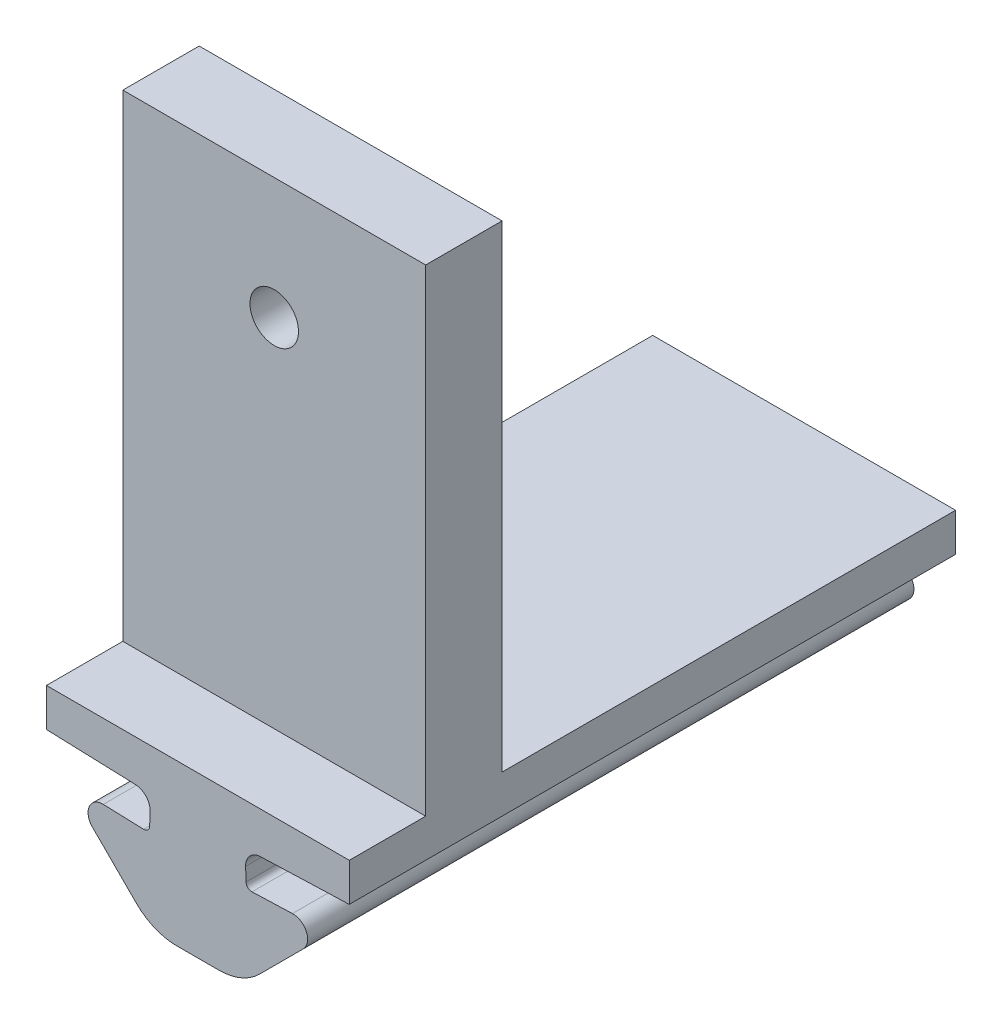
ISO-10303-21;
HEADER;
FILE_DESCRIPTION(('STEP AP214'),'2;1');
FILE_NAME('part.step','',(''),(''),'','','');
FILE_SCHEMA(('AUTOMOTIVE_DESIGN { 1 0 10303 214 1 1 1 1 }'));
ENDSEC;
DATA;
#1=APPLICATION_CONTEXT('core data for automotive mechanical design processes');
#2=APPLICATION_PROTOCOL_DEFINITION('international standard','automotive_design',2000,#1);
#3=PRODUCT_CONTEXT('',#1,'mechanical');
#4=PRODUCT('Part','Part','',(#3));
#5=PRODUCT_RELATED_PRODUCT_CATEGORY('part','',(#4));
#6=PRODUCT_DEFINITION_FORMATION('','',#4);
#7=PRODUCT_DEFINITION_CONTEXT('part definition',#1,'design');
#8=PRODUCT_DEFINITION('design','',#6,#7);
#9=PRODUCT_DEFINITION_SHAPE('','',#8);
#10=(LENGTH_UNIT() NAMED_UNIT(*) SI_UNIT(.MILLI.,.METRE.));
#11=(NAMED_UNIT(*) PLANE_ANGLE_UNIT() SI_UNIT($,.RADIAN.));
#12=(NAMED_UNIT(*) SI_UNIT($,.STERADIAN.) SOLID_ANGLE_UNIT());
#13=UNCERTAINTY_MEASURE_WITH_UNIT(LENGTH_MEASURE(1.E-05),#10,'distance_accuracy_value','');
#14=(GEOMETRIC_REPRESENTATION_CONTEXT(3) GLOBAL_UNCERTAINTY_ASSIGNED_CONTEXT((#13)) GLOBAL_UNIT_ASSIGNED_CONTEXT((#10,
#11,#12)) REPRESENTATION_CONTEXT('',''));
#15=CARTESIAN_POINT('',(0.,0.,0.));
#16=DIRECTION('',(0.,0.,1.));
#17=DIRECTION('',(1.,0.,0.));
#18=AXIS2_PLACEMENT_3D('',#15,#16,#17);
#19=CARTESIAN_POINT('',(0.,49.2995338889829,0.));
#20=DIRECTION('',(0.,1.,0.));
#21=DIRECTION('',(0.,0.,1.));
#22=AXIS2_PLACEMENT_3D('',#19,#20,#21);
#23=PLANE('',#22);
#24=DIRECTION('',(-1.,0.,0.));
#25=VECTOR('',#24,1.);
#26=CARTESIAN_POINT('',(-55.7809025544344,49.2995338889829,23.75));
#27=LINE('',#26,#25);
#28=CARTESIAN_POINT('',(-39.9205005412442,49.2995338889829,23.75));
#29=VERTEX_POINT('',#28);
#30=CARTESIAN_POINT('',(-55.7809025544344,49.2995338889829,23.75));
#31=VERTEX_POINT('',#30);
#32=EDGE_CURVE('E63',#29,#31,#27,.T.);
#33=ORIENTED_EDGE('',*,*,#32,.F.);
#34=DIRECTION('',(0.,0.,-1.));
#35=VECTOR('',#34,1.);
#36=CARTESIAN_POINT('',(-39.9205005412442,49.2995338889829,0.));
#37=LINE('',#36,#35);
#38=CARTESIAN_POINT('',(-39.9205005412442,49.2995338889829,0.));
#39=VERTEX_POINT('',#38);
#40=EDGE_CURVE('E249',#29,#39,#37,.T.);
#41=ORIENTED_EDGE('',*,*,#40,.T.);
#42=DIRECTION('',(-1.,0.,0.));
#43=VECTOR('',#42,1.);
#44=CARTESIAN_POINT('',(-55.7809025544344,49.2995338889829,0.));
#45=LINE('',#44,#43);
#46=CARTESIAN_POINT('',(-55.7809025544344,49.2995338889829,0.));
#47=VERTEX_POINT('',#46);
#48=EDGE_CURVE('E253',#39,#47,#45,.T.);
#49=ORIENTED_EDGE('',*,*,#48,.T.);
#50=DIRECTION('',(0.,0.,1.));
#51=VECTOR('',#50,1.);
#52=CARTESIAN_POINT('',(-55.7809025544344,49.2995338889829,0.));
#53=LINE('',#52,#51);
#54=EDGE_CURVE('E239',#47,#31,#53,.T.);
#55=ORIENTED_EDGE('',*,*,#54,.T.);
#56=EDGE_LOOP('',(#33,#41,#49,#55));
#57=FACE_BOUND('',#56,.T.);
#58=ADVANCED_FACE('F47',(#57),#23,.T.);
#59=CARTESIAN_POINT('',(-50.6754357820215,45.6203327442278,31.75));
#60=DIRECTION('',(0.,0.,-1.));
#61=DIRECTION('',(-1.,0.,0.));
#62=AXIS2_PLACEMENT_3D('',#59,#60,#61);
#63=CYLINDRICAL_SURFACE('',#62,0.300000000000002);
#64=CARTESIAN_POINT('',(-50.6754357820215,45.6203327442278,0.));
#65=DIRECTION('',(0.,0.,-1.));
#66=DIRECTION('',(1.,0.,0.));
#67=AXIS2_PLACEMENT_3D('',#64,#65,#66);
#68=CIRCLE('',#67,0.300000000000002);
#69=CARTESIAN_POINT('',(-50.3756185339158,45.609862895217,0.));
#70=VERTEX_POINT('',#69);
#71=CARTESIAN_POINT('',(-50.6859056310322,45.320515496122,0.));
#72=VERTEX_POINT('',#71);
#73=EDGE_CURVE('E365',#70,#72,#68,.T.);
#74=ORIENTED_EDGE('',*,*,#73,.T.);
#75=DIRECTION('',(0.,0.,-1.));
#76=VECTOR('',#75,1.);
#77=CARTESIAN_POINT('',(-50.6859056310322,45.320515496122,31.75));
#78=LINE('',#77,#76);
#79=CARTESIAN_POINT('',(-50.6859056310322,45.320515496122,31.75));
#80=VERTEX_POINT('',#79);
#81=EDGE_CURVE('E11',#80,#72,#78,.T.);
#82=ORIENTED_EDGE('',*,*,#81,.F.);
#83=CARTESIAN_POINT('',(-50.6754357820215,45.6203327442278,31.75));
#84=DIRECTION('',(0.,0.,-1.));
#85=DIRECTION('',(1.,0.,0.));
#86=AXIS2_PLACEMENT_3D('',#83,#84,#85);
#87=CIRCLE('',#86,0.300000000000002);
#88=CARTESIAN_POINT('',(-50.3756185339158,45.609862895217,31.75));
#89=VERTEX_POINT('',#88);
#90=EDGE_CURVE('E366',#89,#80,#87,.T.);
#91=ORIENTED_EDGE('',*,*,#90,.F.);
#92=DIRECTION('',(0.,0.,-1.));
#93=VECTOR('',#92,1.);
#94=CARTESIAN_POINT('',(-50.3756185339158,45.609862895217,31.75));
#95=LINE('',#94,#93);
#96=EDGE_CURVE('E395',#89,#70,#95,.T.);
#97=ORIENTED_EDGE('',*,*,#96,.T.);
#98=EDGE_LOOP('',(#74,#82,#91,#97));
#99=FACE_BOUND('',#98,.T.);
#100=ADVANCED_FACE('F49',(#99),#63,.F.);
#101=CARTESIAN_POINT('',(-50.6859056310322,45.320515496122,31.75));
#102=DIRECTION('',(-0.0348994967024436,-0.999390827019098,0.));
#103=DIRECTION('',(0.999390827019098,-0.0348994967024436,0.));
#104=AXIS2_PLACEMENT_3D('',#101,#102,#103);
#105=PLANE('',#104);
#106=DIRECTION('',(-0.999390827019098,0.0348994967024436,0.));
#107=VECTOR('',#106,1.);
#108=CARTESIAN_POINT('',(-50.6859056310322,45.320515496122,0.));
#109=LINE('',#108,#107);
#110=CARTESIAN_POINT('',(-52.803734095959,45.3944716957687,0.));
#111=VERTEX_POINT('',#110);
#112=EDGE_CURVE('E399',#72,#111,#109,.T.);
#113=ORIENTED_EDGE('',*,*,#112,.T.);
#114=DIRECTION('',(0.,0.,-1.));
#115=VECTOR('',#114,1.);
#116=CARTESIAN_POINT('',(-52.803734095959,45.3944716957687,31.75));
#117=LINE('',#116,#115);
#118=CARTESIAN_POINT('',(-52.803734095959,45.3944716957687,31.75));
#119=VERTEX_POINT('',#118);
#120=EDGE_CURVE('E56',#119,#111,#117,.T.);
#121=ORIENTED_EDGE('',*,*,#120,.F.);
#122=DIRECTION('',(-0.999390827019098,0.0348994967024436,0.));
#123=VECTOR('',#122,1.);
#124=CARTESIAN_POINT('',(-50.6859056310322,45.320515496122,31.75));
#125=LINE('',#124,#123);
#126=EDGE_CURVE('E370',#80,#119,#125,.T.);
#127=ORIENTED_EDGE('',*,*,#126,.F.);
#128=ORIENTED_EDGE('',*,*,#81,.T.);
#129=EDGE_LOOP('',(#113,#121,#127,#128));
#130=FACE_BOUND('',#129,.T.);
#131=ADVANCED_FACE('F477',(#130),#105,.F.);
#132=CARTESIAN_POINT('',(-52.8306099066512,44.6248491736012,31.75));
#133=DIRECTION('',(0.,0.,-1.));
#134=DIRECTION('',(-1.,0.,0.));
#135=AXIS2_PLACEMENT_3D('',#132,#133,#134);
#136=CYLINDRICAL_SURFACE('',#135,0.770091641188153);
#137=CARTESIAN_POINT('',(-52.8306099066512,44.6248491736012,0.));
#138=DIRECTION('',(0.,0.,1.));
#139=DIRECTION('',(1.,0.,0.));
#140=AXIS2_PLACEMENT_3D('',#137,#138,#139);
#141=CIRCLE('',#140,0.770091641188153);
#142=CARTESIAN_POINT('',(-53.3751469282704,44.0803121519819,0.));
#143=VERTEX_POINT('',#142);
#144=EDGE_CURVE('E402',#111,#143,#141,.T.);
#145=ORIENTED_EDGE('',*,*,#144,.T.);
#146=DIRECTION('',(0.,0.,-1.));
#147=VECTOR('',#146,1.);
#148=CARTESIAN_POINT('',(-53.3751469282704,44.0803121519819,31.75));
#149=LINE('',#148,#147);
#150=CARTESIAN_POINT('',(-53.3751469282704,44.0803121519819,31.75));
#151=VERTEX_POINT('',#150);
#152=EDGE_CURVE('E444',#151,#143,#149,.T.);
#153=ORIENTED_EDGE('',*,*,#152,.F.);
#154=CARTESIAN_POINT('',(-52.8306099066512,44.6248491736012,31.75));
#155=DIRECTION('',(0.,0.,1.));
#156=DIRECTION('',(1.,0.,0.));
#157=AXIS2_PLACEMENT_3D('',#154,#155,#156);
#158=CIRCLE('',#157,0.770091641188153);
#159=EDGE_CURVE('E374',#119,#151,#158,.T.);
#160=ORIENTED_EDGE('',*,*,#159,.F.);
#161=ORIENTED_EDGE('',*,*,#120,.T.);
#162=EDGE_LOOP('',(#145,#153,#160,#161));
#163=FACE_BOUND('',#162,.T.);
#164=ADVANCED_FACE('F453',(#163),#136,.T.);
#165=CARTESIAN_POINT('',(-51.0742666676735,41.7794318913851,31.75));
#166=DIRECTION('',(0.707106781186544,0.707106781186551,0.));
#167=DIRECTION('',(-0.707106781186551,0.707106781186544,0.));
#168=AXIS2_PLACEMENT_3D('',#165,#166,#167);
#169=PLANE('',#168);
#170=DIRECTION('',(0.707106781186551,-0.707106781186544,0.));
#171=VECTOR('',#170,1.);
#172=CARTESIAN_POINT('',(-51.0742666676735,41.7794318913851,0.));
#173=LINE('',#172,#171);
#174=CARTESIAN_POINT('',(-51.0742666676735,41.7794318913851,0.));
#175=VERTEX_POINT('',#174);
#176=EDGE_CURVE('E405',#143,#175,#173,.T.);
#177=ORIENTED_EDGE('',*,*,#176,.T.);
#178=DIRECTION('',(0.,0.,-1.));
#179=VECTOR('',#178,1.);
#180=CARTESIAN_POINT('',(-51.0742666676735,41.7794318913851,31.75));
#181=LINE('',#180,#179);
#182=CARTESIAN_POINT('',(-51.0742666676735,41.7794318913851,31.75));
#183=VERTEX_POINT('',#182);
#184=EDGE_CURVE('E440',#183,#175,#181,.T.);
#185=ORIENTED_EDGE('',*,*,#184,.F.);
#186=DIRECTION('',(0.707106781186551,-0.707106781186544,0.));
#187=VECTOR('',#186,1.);
#188=CARTESIAN_POINT('',(-51.0742666676735,41.7794318913851,31.75));
#189=LINE('',#188,#187);
#190=EDGE_CURVE('E377',#151,#183,#189,.T.);
#191=ORIENTED_EDGE('',*,*,#190,.F.);
#192=ORIENTED_EDGE('',*,*,#152,.T.);
#193=EDGE_LOOP('',(#177,#185,#191,#192));
#194=FACE_BOUND('',#193,.T.);
#195=ADVANCED_FACE('F464',(#194),#169,.F.);
#196=CARTESIAN_POINT('',(-48.9529463241139,43.9007522349447,31.75));
#197=DIRECTION('',(0.,0.,-1.));
#198=DIRECTION('',(-1.,0.,0.));
#199=AXIS2_PLACEMENT_3D('',#196,#197,#198);
#200=CYLINDRICAL_SURFACE('',#199,3.);
#201=CARTESIAN_POINT('',(-48.9529463241139,43.9007522349447,0.));
#202=DIRECTION('',(0.,0.,1.));
#203=DIRECTION('',(1.,0.,0.));
#204=AXIS2_PLACEMENT_3D('',#201,#202,#203);
#205=CIRCLE('',#204,3.);
#206=CARTESIAN_POINT('',(-48.9529463241139,40.9007522349447,0.));
#207=VERTEX_POINT('',#206);
#208=EDGE_CURVE('E408',#175,#207,#205,.T.);
#209=ORIENTED_EDGE('',*,*,#208,.T.);
#210=DIRECTION('',(0.,0.,-1.));
#211=VECTOR('',#210,1.);
#212=CARTESIAN_POINT('',(-48.9529463241139,40.9007522349447,31.75));
#213=LINE('',#212,#211);
#214=CARTESIAN_POINT('',(-48.9529463241139,40.9007522349447,31.75));
#215=VERTEX_POINT('',#214);
#216=EDGE_CURVE('E436',#215,#207,#213,.T.);
#217=ORIENTED_EDGE('',*,*,#216,.F.);
#218=CARTESIAN_POINT('',(-48.9529463241139,43.9007522349447,31.75));
#219=DIRECTION('',(0.,0.,1.));
#220=DIRECTION('',(1.,0.,0.));
#221=AXIS2_PLACEMENT_3D('',#218,#219,#220);
#222=CIRCLE('',#221,3.);
#223=EDGE_CURVE('E380',#183,#215,#222,.T.);
#224=ORIENTED_EDGE('',*,*,#223,.F.);
#225=ORIENTED_EDGE('',*,*,#184,.T.);
#226=EDGE_LOOP('',(#209,#217,#224,#225));
#227=FACE_BOUND('',#226,.T.);
#228=ADVANCED_FACE('F468',(#227),#200,.T.);
#229=CARTESIAN_POINT('',(-47.8507015478393,40.9007522349447,31.75));
#230=DIRECTION('',(0.,1.,0.));
#231=DIRECTION('',(0.,0.,1.));
#232=AXIS2_PLACEMENT_3D('',#229,#230,#231);
#233=PLANE('',#232);
#234=DIRECTION('',(1.,0.,0.));
#235=VECTOR('',#234,1.);
#236=CARTESIAN_POINT('',(-47.8507015478393,40.9007522349447,0.));
#237=LINE('',#236,#235);
#238=CARTESIAN_POINT('',(-46.7484567715648,40.9007522349447,0.));
#239=VERTEX_POINT('',#238);
#240=EDGE_CURVE('E411',#207,#239,#237,.T.);
#241=ORIENTED_EDGE('',*,*,#240,.T.);
#242=DIRECTION('',(0.,0.,-1.));
#243=VECTOR('',#242,1.);
#244=CARTESIAN_POINT('',(-46.7484567715648,40.9007522349447,31.75));
#245=LINE('',#244,#243);
#246=CARTESIAN_POINT('',(-46.7484567715648,40.9007522349447,31.75));
#247=VERTEX_POINT('',#246);
#248=EDGE_CURVE('E348',#247,#239,#245,.T.);
#249=ORIENTED_EDGE('',*,*,#248,.F.);
#250=DIRECTION('',(1.,0.,0.));
#251=VECTOR('',#250,1.);
#252=CARTESIAN_POINT('',(-47.8507015478393,40.9007522349447,31.75));
#253=LINE('',#252,#251);
#254=EDGE_CURVE('E383',#215,#247,#253,.T.);
#255=ORIENTED_EDGE('',*,*,#254,.F.);
#256=ORIENTED_EDGE('',*,*,#216,.T.);
#257=EDGE_LOOP('',(#241,#249,#255,#256));
#258=FACE_BOUND('',#257,.T.);
#259=ADVANCED_FACE('F595',(#258),#233,.F.);
#260=CARTESIAN_POINT('',(-55.7809025544344,47.2995338889829,31.75));
#261=DIRECTION('',(0.0348994967024436,0.999390827019098,0.));
#262=DIRECTION('',(-0.999390827019098,0.0348994967024436,0.));
#263=AXIS2_PLACEMENT_3D('',#260,#261,#262);
#264=PLANE('',#263);
#265=DIRECTION('',(0.999390827019098,-0.0348994967024436,0.));
#266=VECTOR('',#265,1.);
#267=CARTESIAN_POINT('',(-55.7809025544344,47.2995338889829,0.));
#268=LINE('',#267,#266);
#269=CARTESIAN_POINT('',(-55.7809025544344,47.2995338889829,0.));
#270=VERTEX_POINT('',#269);
#271=CARTESIAN_POINT('',(-51.1227819504774,47.1368687331076,0.));
#272=VERTEX_POINT('',#271);
#273=EDGE_CURVE('E414',#270,#272,#268,.T.);
#274=ORIENTED_EDGE('',*,*,#273,.T.);
#275=DIRECTION('',(0.,0.,-1.));
#276=VECTOR('',#275,1.);
#277=CARTESIAN_POINT('',(-51.1227819504774,47.1368687331076,31.75));
#278=LINE('',#277,#276);
#279=CARTESIAN_POINT('',(-51.1227819504774,47.1368687331076,31.75));
#280=VERTEX_POINT('',#279);
#281=EDGE_CURVE('E429',#280,#272,#278,.T.);
#282=ORIENTED_EDGE('',*,*,#281,.F.);
#283=DIRECTION('',(0.999390827019098,-0.0348994967024436,0.));
#284=VECTOR('',#283,1.);
#285=CARTESIAN_POINT('',(-55.7809025544344,47.2995338889829,31.75));
#286=LINE('',#285,#284);
#287=CARTESIAN_POINT('',(-55.7809025544344,47.2995338889829,31.75));
#288=VERTEX_POINT('',#287);
#289=EDGE_CURVE('E386',#288,#280,#286,.T.);
#290=ORIENTED_EDGE('',*,*,#289,.F.);
#291=DIRECTION('',(0.,0.,-1.));
#292=VECTOR('',#291,1.);
#293=CARTESIAN_POINT('',(-55.7809025544344,47.2995338889829,31.75));
#294=LINE('',#293,#292);
#295=EDGE_CURVE('E433',#288,#270,#294,.T.);
#296=ORIENTED_EDGE('',*,*,#295,.T.);
#297=EDGE_LOOP('',(#274,#282,#290,#296));
#298=FACE_BOUND('',#297,.T.);
#299=ADVANCED_FACE('F492',(#298),#264,.F.);
#300=CARTESIAN_POINT('',(-51.1507015478393,46.3373560714924,31.75));
#301=DIRECTION('',(0.,0.,-1.));
#302=DIRECTION('',(-1.,0.,0.));
#303=AXIS2_PLACEMENT_3D('',#300,#301,#302);
#304=CYLINDRICAL_SURFACE('',#303,0.799999999999997);
#305=CARTESIAN_POINT('',(-51.1507015478393,46.3373560714924,0.));
#306=DIRECTION('',(0.,0.,-1.));
#307=DIRECTION('',(1.,0.,0.));
#308=AXIS2_PLACEMENT_3D('',#305,#306,#307);
#309=CIRCLE('',#308,0.799999999999997);
#310=CARTESIAN_POINT('',(-50.3511888862241,46.3094364741304,0.));
#311=VERTEX_POINT('',#310);
#312=EDGE_CURVE('E417',#272,#311,#309,.T.);
#313=ORIENTED_EDGE('',*,*,#312,.T.);
#314=DIRECTION('',(0.,0.,-1.));
#315=VECTOR('',#314,1.);
#316=CARTESIAN_POINT('',(-50.3511888862241,46.3094364741304,31.75));
#317=LINE('',#316,#315);
#318=CARTESIAN_POINT('',(-50.3511888862241,46.3094364741304,31.75));
#319=VERTEX_POINT('',#318);
#320=EDGE_CURVE('E425',#319,#311,#317,.T.);
#321=ORIENTED_EDGE('',*,*,#320,.F.);
#322=CARTESIAN_POINT('',(-51.1507015478393,46.3373560714924,31.75));
#323=DIRECTION('',(0.,0.,-1.));
#324=DIRECTION('',(1.,0.,0.));
#325=AXIS2_PLACEMENT_3D('',#322,#323,#324);
#326=CIRCLE('',#325,0.799999999999997);
#327=EDGE_CURVE('E389',#280,#319,#326,.T.);
#328=ORIENTED_EDGE('',*,*,#327,.F.);
#329=ORIENTED_EDGE('',*,*,#281,.T.);
#330=EDGE_LOOP('',(#313,#321,#328,#329));
#331=FACE_BOUND('',#330,.T.);
#332=ADVANCED_FACE('F489',(#331),#304,.F.);
#333=CARTESIAN_POINT('',(-50.3756185339158,45.609862895217,31.75));
#334=DIRECTION('',(0.999390827019098,-0.034899496702436,0.));
#335=DIRECTION('',(0.034899496702436,0.999390827019098,0.));
#336=AXIS2_PLACEMENT_3D('',#333,#334,#335);
#337=PLANE('',#336);
#338=DIRECTION('',(-0.034899496702436,-0.999390827019098,0.));
#339=VECTOR('',#338,1.);
#340=CARTESIAN_POINT('',(-50.3756185339158,45.609862895217,0.));
#341=LINE('',#340,#339);
#342=EDGE_CURVE('E371',#311,#70,#341,.T.);
#343=ORIENTED_EDGE('',*,*,#342,.T.);
#344=ORIENTED_EDGE('',*,*,#96,.F.);
#345=DIRECTION('',(-0.034899496702436,-0.999390827019098,0.));
#346=VECTOR('',#345,1.);
#347=CARTESIAN_POINT('',(-50.3756185339158,45.609862895217,31.75));
#348=LINE('',#347,#346);
#349=EDGE_CURVE('E392',#319,#89,#348,.T.);
#350=ORIENTED_EDGE('',*,*,#349,.F.);
#351=ORIENTED_EDGE('',*,*,#320,.T.);
#352=EDGE_LOOP('',(#343,#344,#350,#351));
#353=FACE_BOUND('',#352,.T.);
#354=ADVANCED_FACE('F484',(#353),#337,.F.);
#355=CARTESIAN_POINT('',(-50.6754357820215,45.6203327442278,31.75));
#356=DIRECTION('',(0.,0.,1.));
#357=DIRECTION('',(1.,0.,0.));
#358=AXIS2_PLACEMENT_3D('',#355,#356,#357);
#359=PLANE('',#358);
#360=ORIENTED_EDGE('',*,*,#90,.T.);
#361=ORIENTED_EDGE('',*,*,#126,.T.);
#362=ORIENTED_EDGE('',*,*,#159,.T.);
#363=ORIENTED_EDGE('',*,*,#190,.T.);
#364=ORIENTED_EDGE('',*,*,#223,.T.);
#365=ORIENTED_EDGE('',*,*,#254,.T.);
#366=CARTESIAN_POINT('',(-46.7484567715648,43.9007522349447,31.75));
#367=DIRECTION('',(0.,0.,-1.));
#368=DIRECTION('',(-1.,0.,0.));
#369=AXIS2_PLACEMENT_3D('',#366,#367,#368);
#370=CIRCLE('',#369,3.);
#371=CARTESIAN_POINT('',(-44.6271364280052,41.7794318913851,31.75));
#372=VERTEX_POINT('',#371);
#373=EDGE_CURVE('E290',#372,#247,#370,.T.);
#374=ORIENTED_EDGE('',*,*,#373,.F.);
#375=DIRECTION('',(-0.707106781186551,-0.707106781186544,0.));
#376=VECTOR('',#375,1.);
#377=CARTESIAN_POINT('',(-44.6271364280052,41.7794318913851,31.75));
#378=LINE('',#377,#376);
#379=CARTESIAN_POINT('',(-42.3262561674083,44.0803121519819,31.75));
#380=VERTEX_POINT('',#379);
#381=EDGE_CURVE('E294',#380,#372,#378,.T.);
#382=ORIENTED_EDGE('',*,*,#381,.F.);
#383=CARTESIAN_POINT('',(-42.8707931890275,44.6248491736012,31.75));
#384=DIRECTION('',(0.,0.,-1.));
#385=DIRECTION('',(-1.,0.,0.));
#386=AXIS2_PLACEMENT_3D('',#383,#384,#385);
#387=CIRCLE('',#386,0.770091641188153);
#388=CARTESIAN_POINT('',(-42.8976689997197,45.3944716957687,31.75));
#389=VERTEX_POINT('',#388);
#390=EDGE_CURVE('E298',#389,#380,#387,.T.);
#391=ORIENTED_EDGE('',*,*,#390,.F.);
#392=DIRECTION('',(0.999390827019098,0.0348994967024436,0.));
#393=VECTOR('',#392,1.);
#394=CARTESIAN_POINT('',(-45.0154974646464,45.320515496122,31.75));
#395=LINE('',#394,#393);
#396=CARTESIAN_POINT('',(-45.0154974646464,45.320515496122,31.75));
#397=VERTEX_POINT('',#396);
#398=EDGE_CURVE('E302',#397,#389,#395,.T.);
#399=ORIENTED_EDGE('',*,*,#398,.F.);
#400=CARTESIAN_POINT('',(-45.0259673136572,45.6203327442278,31.75));
#401=DIRECTION('',(0.,0.,1.));
#402=DIRECTION('',(-1.,0.,0.));
#403=AXIS2_PLACEMENT_3D('',#400,#401,#402);
#404=CIRCLE('',#403,0.300000000000002);
#405=CARTESIAN_POINT('',(-45.3257845617629,45.609862895217,31.75));
#406=VERTEX_POINT('',#405);
#407=EDGE_CURVE('E273',#406,#397,#404,.T.);
#408=ORIENTED_EDGE('',*,*,#407,.F.);
#409=DIRECTION('',(0.034899496702436,-0.999390827019098,0.));
#410=VECTOR('',#409,1.);
#411=CARTESIAN_POINT('',(-45.3257845617629,45.609862895217,31.75));
#412=LINE('',#411,#410);
#413=CARTESIAN_POINT('',(-45.3502142094546,46.3094364741304,31.75));
#414=VERTEX_POINT('',#413);
#415=EDGE_CURVE('E277',#414,#406,#412,.T.);
#416=ORIENTED_EDGE('',*,*,#415,.F.);
#417=CARTESIAN_POINT('',(-44.5507015478393,46.3373560714924,31.75));
#418=DIRECTION('',(0.,0.,1.));
#419=DIRECTION('',(-1.,0.,0.));
#420=AXIS2_PLACEMENT_3D('',#417,#418,#419);
#421=CIRCLE('',#420,0.799999999999997);
#422=CARTESIAN_POINT('',(-44.5786211452013,47.1368687331076,31.75));
#423=VERTEX_POINT('',#422);
#424=EDGE_CURVE('E282',#423,#414,#421,.T.);
#425=ORIENTED_EDGE('',*,*,#424,.F.);
#426=DIRECTION('',(-0.999390827019098,-0.0348994967024436,0.));
#427=VECTOR('',#426,1.);
#428=CARTESIAN_POINT('',(-39.9205005412442,47.2995338889829,31.75));
#429=LINE('',#428,#427);
#430=CARTESIAN_POINT('',(-39.9205005412442,47.2995338889829,31.75));
#431=VERTEX_POINT('',#430);
#432=EDGE_CURVE('E286',#431,#423,#429,.T.);
#433=ORIENTED_EDGE('',*,*,#432,.F.);
#434=DIRECTION('',(0.,-1.,0.));
#435=VECTOR('',#434,1.);
#436=CARTESIAN_POINT('',(-39.9205005412442,49.2995338889829,31.75));
#437=LINE('',#436,#435);
#438=CARTESIAN_POINT('',(-39.9205005412442,49.2995338889829,31.75));
#439=VERTEX_POINT('',#438);
#440=EDGE_CURVE('E264',#439,#431,#437,.T.);
#441=ORIENTED_EDGE('',*,*,#440,.F.);
#442=DIRECTION('',(1.,0.,0.));
#443=VECTOR('',#442,1.);
#444=CARTESIAN_POINT('',(-55.7809025544344,49.2995338889829,31.75));
#445=LINE('',#444,#443);
#446=CARTESIAN_POINT('',(-55.7809025544344,49.2995338889829,31.75));
#447=VERTEX_POINT('',#446);
#448=EDGE_CURVE('E246',#447,#439,#445,.T.);
#449=ORIENTED_EDGE('',*,*,#448,.F.);
#450=DIRECTION('',(0.,-1.,0.));
#451=VECTOR('',#450,1.);
#452=CARTESIAN_POINT('',(-55.7809025544344,49.2995338889829,31.75));
#453=LINE('',#452,#451);
#454=EDGE_CURVE('E268',#447,#288,#453,.T.);
#455=ORIENTED_EDGE('',*,*,#454,.T.);
#456=ORIENTED_EDGE('',*,*,#289,.T.);
#457=ORIENTED_EDGE('',*,*,#327,.T.);
#458=ORIENTED_EDGE('',*,*,#349,.T.);
#459=EDGE_LOOP('',(#360,#361,#362,#363,#364,#365,#374,#382,#391,#399,#408,#416,#425,#433,#441,
#449,#455,#456,#457,#458));
#460=FACE_BOUND('',#459,.T.);
#461=ADVANCED_FACE('F472',(#460),#359,.T.);
#462=CARTESIAN_POINT('',(-50.6754357820215,45.6203327442278,0.));
#463=DIRECTION('',(0.,0.,1.));
#464=DIRECTION('',(1.,0.,0.));
#465=AXIS2_PLACEMENT_3D('',#462,#463,#464);
#466=PLANE('',#465);
#467=ORIENTED_EDGE('',*,*,#73,.F.);
#468=ORIENTED_EDGE('',*,*,#342,.F.);
#469=ORIENTED_EDGE('',*,*,#312,.F.);
#470=ORIENTED_EDGE('',*,*,#273,.F.);
#471=DIRECTION('',(0.,-1.,0.));
#472=VECTOR('',#471,1.);
#473=CARTESIAN_POINT('',(-55.7809025544344,49.2995338889829,0.));
#474=LINE('',#473,#472);
#475=EDGE_CURVE('E256',#47,#270,#474,.T.);
#476=ORIENTED_EDGE('',*,*,#475,.F.);
#477=ORIENTED_EDGE('',*,*,#48,.F.);
#478=DIRECTION('',(0.,-1.,0.));
#479=VECTOR('',#478,1.);
#480=CARTESIAN_POINT('',(-39.9205005412442,49.2995338889829,0.));
#481=LINE('',#480,#479);
#482=CARTESIAN_POINT('',(-39.9205005412442,47.2995338889829,0.));
#483=VERTEX_POINT('',#482);
#484=EDGE_CURVE('E260',#39,#483,#481,.T.);
#485=ORIENTED_EDGE('',*,*,#484,.T.);
#486=DIRECTION('',(-0.999390827019098,-0.0348994967024436,0.));
#487=VECTOR('',#486,1.);
#488=CARTESIAN_POINT('',(-39.9205005412442,47.2995338889829,0.));
#489=LINE('',#488,#487);
#490=CARTESIAN_POINT('',(-44.5786211452013,47.1368687331076,0.));
#491=VERTEX_POINT('',#490);
#492=EDGE_CURVE('E318',#483,#491,#489,.T.);
#493=ORIENTED_EDGE('',*,*,#492,.T.);
#494=CARTESIAN_POINT('',(-44.5507015478393,46.3373560714924,0.));
#495=DIRECTION('',(0.,0.,1.));
#496=DIRECTION('',(-1.,0.,0.));
#497=AXIS2_PLACEMENT_3D('',#494,#495,#496);
#498=CIRCLE('',#497,0.799999999999997);
#499=CARTESIAN_POINT('',(-45.3502142094546,46.3094364741304,0.));
#500=VERTEX_POINT('',#499);
#501=EDGE_CURVE('E314',#491,#500,#498,.T.);
#502=ORIENTED_EDGE('',*,*,#501,.T.);
#503=DIRECTION('',(0.034899496702436,-0.999390827019098,0.));
#504=VECTOR('',#503,1.);
#505=CARTESIAN_POINT('',(-45.3257845617629,45.609862895217,0.));
#506=LINE('',#505,#504);
#507=CARTESIAN_POINT('',(-45.3257845617629,45.609862895217,0.));
#508=VERTEX_POINT('',#507);
#509=EDGE_CURVE('E310',#500,#508,#506,.T.);
#510=ORIENTED_EDGE('',*,*,#509,.T.);
#511=CARTESIAN_POINT('',(-45.0259673136572,45.6203327442278,0.));
#512=DIRECTION('',(0.,0.,1.));
#513=DIRECTION('',(-1.,0.,0.));
#514=AXIS2_PLACEMENT_3D('',#511,#512,#513);
#515=CIRCLE('',#514,0.300000000000002);
#516=CARTESIAN_POINT('',(-45.0154974646464,45.320515496122,0.));
#517=VERTEX_POINT('',#516);
#518=EDGE_CURVE('E272',#508,#517,#515,.T.);
#519=ORIENTED_EDGE('',*,*,#518,.T.);
#520=DIRECTION('',(0.999390827019098,0.0348994967024436,0.));
#521=VECTOR('',#520,1.);
#522=CARTESIAN_POINT('',(-45.0154974646464,45.320515496122,0.));
#523=LINE('',#522,#521);
#524=CARTESIAN_POINT('',(-42.8976689997197,45.3944716957687,0.));
#525=VERTEX_POINT('',#524);
#526=EDGE_CURVE('E278',#517,#525,#523,.T.);
#527=ORIENTED_EDGE('',*,*,#526,.T.);
#528=CARTESIAN_POINT('',(-42.8707931890275,44.6248491736012,0.));
#529=DIRECTION('',(0.,0.,-1.));
#530=DIRECTION('',(-1.,0.,0.));
#531=AXIS2_PLACEMENT_3D('',#528,#529,#530);
#532=CIRCLE('',#531,0.770091641188153);
#533=CARTESIAN_POINT('',(-42.3262561674083,44.0803121519819,0.));
#534=VERTEX_POINT('',#533);
#535=EDGE_CURVE('E330',#525,#534,#532,.T.);
#536=ORIENTED_EDGE('',*,*,#535,.T.);
#537=DIRECTION('',(-0.707106781186551,-0.707106781186544,0.));
#538=VECTOR('',#537,1.);
#539=CARTESIAN_POINT('',(-44.6271364280052,41.7794318913851,0.));
#540=LINE('',#539,#538);
#541=CARTESIAN_POINT('',(-44.6271364280052,41.7794318913851,0.));
#542=VERTEX_POINT('',#541);
#543=EDGE_CURVE('E326',#534,#542,#540,.T.);
#544=ORIENTED_EDGE('',*,*,#543,.T.);
#545=CARTESIAN_POINT('',(-46.7484567715648,43.9007522349447,0.));
#546=DIRECTION('',(0.,0.,-1.));
#547=DIRECTION('',(-1.,0.,0.));
#548=AXIS2_PLACEMENT_3D('',#545,#546,#547);
#549=CIRCLE('',#548,3.);
#550=EDGE_CURVE('E322',#542,#239,#549,.T.);
#551=ORIENTED_EDGE('',*,*,#550,.T.);
#552=ORIENTED_EDGE('',*,*,#240,.F.);
#553=ORIENTED_EDGE('',*,*,#208,.F.);
#554=ORIENTED_EDGE('',*,*,#176,.F.);
#555=ORIENTED_EDGE('',*,*,#144,.F.);
#556=ORIENTED_EDGE('',*,*,#112,.F.);
#557=EDGE_LOOP('',(#467,#468,#469,#470,#476,#477,#485,#493,#502,#510,#519,#527,#536,#544,#551,
#552,#553,#554,#555,#556));
#558=FACE_BOUND('',#557,.T.);
#559=ADVANCED_FACE('F459',(#558),#466,.F.);
#560=CARTESIAN_POINT('',(-45.0259673136572,45.6203327442278,31.75));
#561=DIRECTION('',(0.,0.,-1.));
#562=DIRECTION('',(-1.,0.,0.));
#563=AXIS2_PLACEMENT_3D('',#560,#561,#562);
#564=CYLINDRICAL_SURFACE('',#563,0.300000000000002);
#565=ORIENTED_EDGE('',*,*,#518,.F.);
#566=DIRECTION('',(0.,0.,-1.));
#567=VECTOR('',#566,1.);
#568=CARTESIAN_POINT('',(-45.3257845617629,45.609862895217,31.75));
#569=LINE('',#568,#567);
#570=EDGE_CURVE('E362',#406,#508,#569,.T.);
#571=ORIENTED_EDGE('',*,*,#570,.F.);
#572=ORIENTED_EDGE('',*,*,#407,.T.);
#573=DIRECTION('',(0.,0.,-1.));
#574=VECTOR('',#573,1.);
#575=CARTESIAN_POINT('',(-45.0154974646464,45.320515496122,31.75));
#576=LINE('',#575,#574);
#577=EDGE_CURVE('E306',#397,#517,#576,.T.);
#578=ORIENTED_EDGE('',*,*,#577,.T.);
#579=EDGE_LOOP('',(#565,#571,#572,#578));
#580=FACE_BOUND('',#579,.T.);
#581=ADVANCED_FACE('F580',(#580),#564,.F.);
#582=CARTESIAN_POINT('',(-45.3257845617629,45.609862895217,31.75));
#583=DIRECTION('',(0.999390827019098,0.034899496702436,0.));
#584=DIRECTION('',(-0.034899496702436,0.999390827019098,0.));
#585=AXIS2_PLACEMENT_3D('',#582,#583,#584);
#586=PLANE('',#585);
#587=ORIENTED_EDGE('',*,*,#509,.F.);
#588=DIRECTION('',(0.,0.,-1.));
#589=VECTOR('',#588,1.);
#590=CARTESIAN_POINT('',(-45.3502142094546,46.3094364741304,31.75));
#591=LINE('',#590,#589);
#592=EDGE_CURVE('E359',#414,#500,#591,.T.);
#593=ORIENTED_EDGE('',*,*,#592,.F.);
#594=ORIENTED_EDGE('',*,*,#415,.T.);
#595=ORIENTED_EDGE('',*,*,#570,.T.);
#596=EDGE_LOOP('',(#587,#593,#594,#595));
#597=FACE_BOUND('',#596,.T.);
#598=ADVANCED_FACE('F576',(#597),#586,.T.);
#599=CARTESIAN_POINT('',(-44.5507015478393,46.3373560714924,31.75));
#600=DIRECTION('',(0.,0.,-1.));
#601=DIRECTION('',(-1.,0.,0.));
#602=AXIS2_PLACEMENT_3D('',#599,#600,#601);
#603=CYLINDRICAL_SURFACE('',#602,0.799999999999997);
#604=ORIENTED_EDGE('',*,*,#501,.F.);
#605=DIRECTION('',(0.,0.,-1.));
#606=VECTOR('',#605,1.);
#607=CARTESIAN_POINT('',(-44.5786211452013,47.1368687331076,31.75));
#608=LINE('',#607,#606);
#609=EDGE_CURVE('E356',#423,#491,#608,.T.);
#610=ORIENTED_EDGE('',*,*,#609,.F.);
#611=ORIENTED_EDGE('',*,*,#424,.T.);
#612=ORIENTED_EDGE('',*,*,#592,.T.);
#613=EDGE_LOOP('',(#604,#610,#611,#612));
#614=FACE_BOUND('',#613,.T.);
#615=ADVANCED_FACE('F572',(#614),#603,.F.);
#616=CARTESIAN_POINT('',(-39.9205005412442,47.2995338889829,31.75));
#617=DIRECTION('',(0.0348994967024436,-0.999390827019098,0.));
#618=DIRECTION('',(0.999390827019098,0.0348994967024436,0.));
#619=AXIS2_PLACEMENT_3D('',#616,#617,#618);
#620=PLANE('',#619);
#621=ORIENTED_EDGE('',*,*,#492,.F.);
#622=DIRECTION('',(0.,0.,-1.));
#623=VECTOR('',#622,1.);
#624=CARTESIAN_POINT('',(-39.9205005412442,47.2995338889829,31.75));
#625=LINE('',#624,#623);
#626=EDGE_CURVE('E352',#431,#483,#625,.T.);
#627=ORIENTED_EDGE('',*,*,#626,.F.);
#628=ORIENTED_EDGE('',*,*,#432,.T.);
#629=ORIENTED_EDGE('',*,*,#609,.T.);
#630=EDGE_LOOP('',(#621,#627,#628,#629));
#631=FACE_BOUND('',#630,.T.);
#632=ADVANCED_FACE('F569',(#631),#620,.T.);
#633=CARTESIAN_POINT('',(-46.7484567715648,43.9007522349447,31.75));
#634=DIRECTION('',(0.,0.,-1.));
#635=DIRECTION('',(-1.,0.,0.));
#636=AXIS2_PLACEMENT_3D('',#633,#634,#635);
#637=CYLINDRICAL_SURFACE('',#636,3.);
#638=ORIENTED_EDGE('',*,*,#550,.F.);
#639=DIRECTION('',(0.,0.,-1.));
#640=VECTOR('',#639,1.);
#641=CARTESIAN_POINT('',(-44.6271364280052,41.7794318913851,31.75));
#642=LINE('',#641,#640);
#643=EDGE_CURVE('E345',#372,#542,#642,.T.);
#644=ORIENTED_EDGE('',*,*,#643,.F.);
#645=ORIENTED_EDGE('',*,*,#373,.T.);
#646=ORIENTED_EDGE('',*,*,#248,.T.);
#647=EDGE_LOOP('',(#638,#644,#645,#646));
#648=FACE_BOUND('',#647,.T.);
#649=ADVANCED_FACE('F565',(#648),#637,.T.);
#650=CARTESIAN_POINT('',(-44.6271364280052,41.7794318913851,31.75));
#651=DIRECTION('',(0.707106781186544,-0.707106781186551,0.));
#652=DIRECTION('',(0.707106781186551,0.707106781186544,0.));
#653=AXIS2_PLACEMENT_3D('',#650,#651,#652);
#654=PLANE('',#653);
#655=ORIENTED_EDGE('',*,*,#543,.F.);
#656=DIRECTION('',(0.,0.,-1.));
#657=VECTOR('',#656,1.);
#658=CARTESIAN_POINT('',(-42.3262561674083,44.0803121519819,31.75));
#659=LINE('',#658,#657);
#660=EDGE_CURVE('E342',#380,#534,#659,.T.);
#661=ORIENTED_EDGE('',*,*,#660,.F.);
#662=ORIENTED_EDGE('',*,*,#381,.T.);
#663=ORIENTED_EDGE('',*,*,#643,.T.);
#664=EDGE_LOOP('',(#655,#661,#662,#663));
#665=FACE_BOUND('',#664,.T.);
#666=ADVANCED_FACE('F561',(#665),#654,.T.);
#667=CARTESIAN_POINT('',(-42.8707931890275,44.6248491736012,31.75));
#668=DIRECTION('',(0.,0.,-1.));
#669=DIRECTION('',(-1.,0.,0.));
#670=AXIS2_PLACEMENT_3D('',#667,#668,#669);
#671=CYLINDRICAL_SURFACE('',#670,0.770091641188153);
#672=ORIENTED_EDGE('',*,*,#535,.F.);
#673=DIRECTION('',(0.,0.,-1.));
#674=VECTOR('',#673,1.);
#675=CARTESIAN_POINT('',(-42.8976689997197,45.3944716957687,31.75));
#676=LINE('',#675,#674);
#677=EDGE_CURVE('E339',#389,#525,#676,.T.);
#678=ORIENTED_EDGE('',*,*,#677,.F.);
#679=ORIENTED_EDGE('',*,*,#390,.T.);
#680=ORIENTED_EDGE('',*,*,#660,.T.);
#681=EDGE_LOOP('',(#672,#678,#679,#680));
#682=FACE_BOUND('',#681,.T.);
#683=ADVANCED_FACE('F557',(#682),#671,.T.);
#684=CARTESIAN_POINT('',(-45.0154974646464,45.320515496122,31.75));
#685=DIRECTION('',(-0.0348994967024436,0.999390827019098,0.));
#686=DIRECTION('',(-0.999390827019098,-0.0348994967024436,0.));
#687=AXIS2_PLACEMENT_3D('',#684,#685,#686);
#688=PLANE('',#687);
#689=ORIENTED_EDGE('',*,*,#526,.F.);
#690=ORIENTED_EDGE('',*,*,#577,.F.);
#691=ORIENTED_EDGE('',*,*,#398,.T.);
#692=ORIENTED_EDGE('',*,*,#677,.T.);
#693=EDGE_LOOP('',(#689,#690,#691,#692));
#694=FACE_BOUND('',#693,.T.);
#695=ADVANCED_FACE('F552',(#694),#688,.T.);
#696=CARTESIAN_POINT('',(-55.7809025544344,49.2995338889829,0.));
#697=DIRECTION('',(1.,0.,0.));
#698=DIRECTION('',(0.,0.,-1.));
#699=AXIS2_PLACEMENT_3D('',#696,#697,#698);
#700=PLANE('',#699);
#701=ORIENTED_EDGE('',*,*,#295,.F.);
#702=ORIENTED_EDGE('',*,*,#454,.F.);
#703=CARTESIAN_POINT('',(-55.7809025544344,49.2995338889829,27.75));
#704=VERTEX_POINT('',#703);
#705=EDGE_CURVE('E234',#704,#447,#53,.T.);
#706=ORIENTED_EDGE('',*,*,#705,.F.);
#707=DIRECTION('',(0.,-1.,0.));
#708=VECTOR('',#707,1.);
#709=CARTESIAN_POINT('',(-55.7809025544344,74.2995338889829,27.75));
#710=LINE('',#709,#708);
#711=CARTESIAN_POINT('',(-55.7809025544344,74.2995338889829,27.75));
#712=VERTEX_POINT('',#711);
#713=EDGE_CURVE('E213',#712,#704,#710,.T.);
#714=ORIENTED_EDGE('',*,*,#713,.F.);
#715=DIRECTION('',(0.,0.,1.));
#716=VECTOR('',#715,1.);
#717=CARTESIAN_POINT('',(-55.7809025544344,74.2995338889829,23.75));
#718=LINE('',#717,#716);
#719=CARTESIAN_POINT('',(-55.7809025544344,74.2995338889829,23.75));
#720=VERTEX_POINT('',#719);
#721=EDGE_CURVE('E220',#720,#712,#718,.T.);
#722=ORIENTED_EDGE('',*,*,#721,.F.);
#723=DIRECTION('',(0.,-1.,0.));
#724=VECTOR('',#723,1.);
#725=CARTESIAN_POINT('',(-55.7809025544344,74.2995338889829,23.75));
#726=LINE('',#725,#724);
#727=EDGE_CURVE('E496',#720,#31,#726,.T.);
#728=ORIENTED_EDGE('',*,*,#727,.T.);
#729=ORIENTED_EDGE('',*,*,#54,.F.);
#730=ORIENTED_EDGE('',*,*,#475,.T.);
#731=EDGE_LOOP('',(#701,#702,#706,#714,#722,#728,#729,#730));
#732=FACE_BOUND('',#731,.T.);
#733=ADVANCED_FACE('F232',(#732),#700,.F.);
#734=CARTESIAN_POINT('',(-39.9205005412442,49.2995338889829,0.));
#735=DIRECTION('',(-1.,0.,0.));
#736=DIRECTION('',(0.,0.,1.));
#737=AXIS2_PLACEMENT_3D('',#734,#735,#736);
#738=PLANE('',#737);
#739=ORIENTED_EDGE('',*,*,#626,.T.);
#740=ORIENTED_EDGE('',*,*,#484,.F.);
#741=ORIENTED_EDGE('',*,*,#40,.F.);
#742=DIRECTION('',(0.,-1.,0.));
#743=VECTOR('',#742,1.);
#744=CARTESIAN_POINT('',(-39.9205005412442,74.2995338889829,23.75));
#745=LINE('',#744,#743);
#746=CARTESIAN_POINT('',(-39.9205005412442,74.2995338889829,23.75));
#747=VERTEX_POINT('',#746);
#748=EDGE_CURVE('E241',#747,#29,#745,.T.);
#749=ORIENTED_EDGE('',*,*,#748,.F.);
#750=DIRECTION('',(0.,0.,-1.));
#751=VECTOR('',#750,1.);
#752=CARTESIAN_POINT('',(-39.9205005412442,74.2995338889829,23.75));
#753=LINE('',#752,#751);
#754=CARTESIAN_POINT('',(-39.9205005412442,74.2995338889829,27.75));
#755=VERTEX_POINT('',#754);
#756=EDGE_CURVE('E219',#755,#747,#753,.T.);
#757=ORIENTED_EDGE('',*,*,#756,.F.);
#758=DIRECTION('',(0.,-1.,0.));
#759=VECTOR('',#758,1.);
#760=CARTESIAN_POINT('',(-39.9205005412442,74.2995338889829,27.75));
#761=LINE('',#760,#759);
#762=CARTESIAN_POINT('',(-39.9205005412442,49.2995338889829,27.75));
#763=VERTEX_POINT('',#762);
#764=EDGE_CURVE('E215',#755,#763,#761,.T.);
#765=ORIENTED_EDGE('',*,*,#764,.T.);
#766=EDGE_CURVE('E250',#439,#763,#37,.T.);
#767=ORIENTED_EDGE('',*,*,#766,.F.);
#768=ORIENTED_EDGE('',*,*,#440,.T.);
#769=EDGE_LOOP('',(#739,#740,#741,#749,#757,#765,#767,#768));
#770=FACE_BOUND('',#769,.T.);
#771=ADVANCED_FACE('F545',(#770),#738,.F.);
#772=DIRECTION('',(1.,0.,0.));
#773=VECTOR('',#772,1.);
#774=CARTESIAN_POINT('',(-55.7809025544344,49.2995338889829,27.75));
#775=LINE('',#774,#773);
#776=EDGE_CURVE('E71',#704,#763,#775,.T.);
#777=ORIENTED_EDGE('',*,*,#776,.F.);
#778=ORIENTED_EDGE('',*,*,#705,.T.);
#779=ORIENTED_EDGE('',*,*,#448,.T.);
#780=ORIENTED_EDGE('',*,*,#766,.T.);
#781=EDGE_LOOP('',(#777,#778,#779,#780));
#782=FACE_BOUND('',#781,.T.);
#783=ADVANCED_FACE('F533',(#782),#23,.T.);
#784=CARTESIAN_POINT('',(-55.7809025544344,74.2995338889829,27.75));
#785=DIRECTION('',(0.,0.,-1.));
#786=DIRECTION('',(-1.,0.,0.));
#787=AXIS2_PLACEMENT_3D('',#784,#785,#786);
#788=PLANE('',#787);
#789=CARTESIAN_POINT('',(-47.8507015478393,67.9495338889829,27.75));
#790=DIRECTION('',(0.,0.,-1.));
#791=DIRECTION('',(-1.,0.,0.));
#792=AXIS2_PLACEMENT_3D('',#789,#790,#791);
#793=CIRCLE('',#792,1.27);
#794=CARTESIAN_POINT('',(-49.1207015478393,67.9495338889829,27.75));
#795=VERTEX_POINT('',#794);
#796=EDGE_CURVE('E504',#795,#795,#793,.T.);
#797=ORIENTED_EDGE('',*,*,#796,.T.);
#798=EDGE_LOOP('',(#797));
#799=FACE_BOUND('',#798,.T.);
#800=ORIENTED_EDGE('',*,*,#776,.T.);
#801=ORIENTED_EDGE('',*,*,#764,.F.);
#802=DIRECTION('',(1.,0.,0.));
#803=VECTOR('',#802,1.);
#804=CARTESIAN_POINT('',(-55.7809025544344,74.2995338889829,27.75));
#805=LINE('',#804,#803);
#806=EDGE_CURVE('E209',#712,#755,#805,.T.);
#807=ORIENTED_EDGE('',*,*,#806,.F.);
#808=ORIENTED_EDGE('',*,*,#713,.T.);
#809=EDGE_LOOP('',(#800,#801,#807,#808));
#810=FACE_BOUND('',#809,.T.);
#811=ADVANCED_FACE('F211',(#799,#810),#788,.F.);
#812=CARTESIAN_POINT('',(-55.7809025544344,74.2995338889829,23.75));
#813=DIRECTION('',(0.,0.,1.));
#814=DIRECTION('',(1.,0.,0.));
#815=AXIS2_PLACEMENT_3D('',#812,#813,#814);
#816=PLANE('',#815);
#817=CARTESIAN_POINT('',(-47.8507015478393,67.9495338889829,23.75));
#818=DIRECTION('',(0.,0.,-1.));
#819=DIRECTION('',(-1.,0.,0.));
#820=AXIS2_PLACEMENT_3D('',#817,#818,#819);
#821=CIRCLE('',#820,1.27);
#822=CARTESIAN_POINT('',(-49.1207015478393,67.9495338889829,23.75));
#823=VERTEX_POINT('',#822);
#824=EDGE_CURVE('E517',#823,#823,#821,.T.);
#825=ORIENTED_EDGE('',*,*,#824,.F.);
#826=EDGE_LOOP('',(#825));
#827=FACE_BOUND('',#826,.T.);
#828=ORIENTED_EDGE('',*,*,#32,.T.);
#829=ORIENTED_EDGE('',*,*,#727,.F.);
#830=DIRECTION('',(-1.,0.,0.));
#831=VECTOR('',#830,1.);
#832=CARTESIAN_POINT('',(-55.7809025544344,74.2995338889829,23.75));
#833=LINE('',#832,#831);
#834=EDGE_CURVE('E225',#747,#720,#833,.T.);
#835=ORIENTED_EDGE('',*,*,#834,.F.);
#836=ORIENTED_EDGE('',*,*,#748,.T.);
#837=EDGE_LOOP('',(#828,#829,#835,#836));
#838=FACE_BOUND('',#837,.T.);
#839=ADVANCED_FACE('F499',(#827,#838),#816,.F.);
#840=CARTESIAN_POINT('',(0.,74.2995338889829,0.));
#841=DIRECTION('',(0.,1.,0.));
#842=DIRECTION('',(0.,0.,1.));
#843=AXIS2_PLACEMENT_3D('',#840,#841,#842);
#844=PLANE('',#843);
#845=ORIENTED_EDGE('',*,*,#721,.T.);
#846=ORIENTED_EDGE('',*,*,#806,.T.);
#847=ORIENTED_EDGE('',*,*,#756,.T.);
#848=ORIENTED_EDGE('',*,*,#834,.T.);
#849=EDGE_LOOP('',(#845,#846,#847,#848));
#850=FACE_BOUND('',#849,.T.);
#851=ADVANCED_FACE('F223',(#850),#844,.T.);
#852=CARTESIAN_POINT('',(-47.8507015478393,67.9495338889829,31.75));
#853=DIRECTION('',(0.,0.,-1.));
#854=DIRECTION('',(-1.,0.,0.));
#855=AXIS2_PLACEMENT_3D('',#852,#853,#854);
#856=CYLINDRICAL_SURFACE('',#855,1.27);
#857=ORIENTED_EDGE('',*,*,#824,.T.);
#858=EDGE_LOOP('',(#857));
#859=FACE_BOUND('',#858,.T.);
#860=ORIENTED_EDGE('',*,*,#796,.F.);
#861=EDGE_LOOP('',(#860));
#862=FACE_BOUND('',#861,.T.);
#863=ADVANCED_FACE('F522',(#859,#862),#856,.F.);
#864=CLOSED_SHELL('',(#58,#100,#131,#164,#195,#228,#259,#299,#332,#354,#461,#559,#581,#598,#615,
#632,#649,#666,#683,#695,#733,#771,#783,#811,#839,#851,#863));
#865=MANIFOLD_SOLID_BREP('B2',#864);
#866=ADVANCED_BREP_SHAPE_REPRESENTATION('',(#18,#865),#14);
#867=SHAPE_DEFINITION_REPRESENTATION(#9,#866);
ENDSEC;
END-ISO-10303-21;
